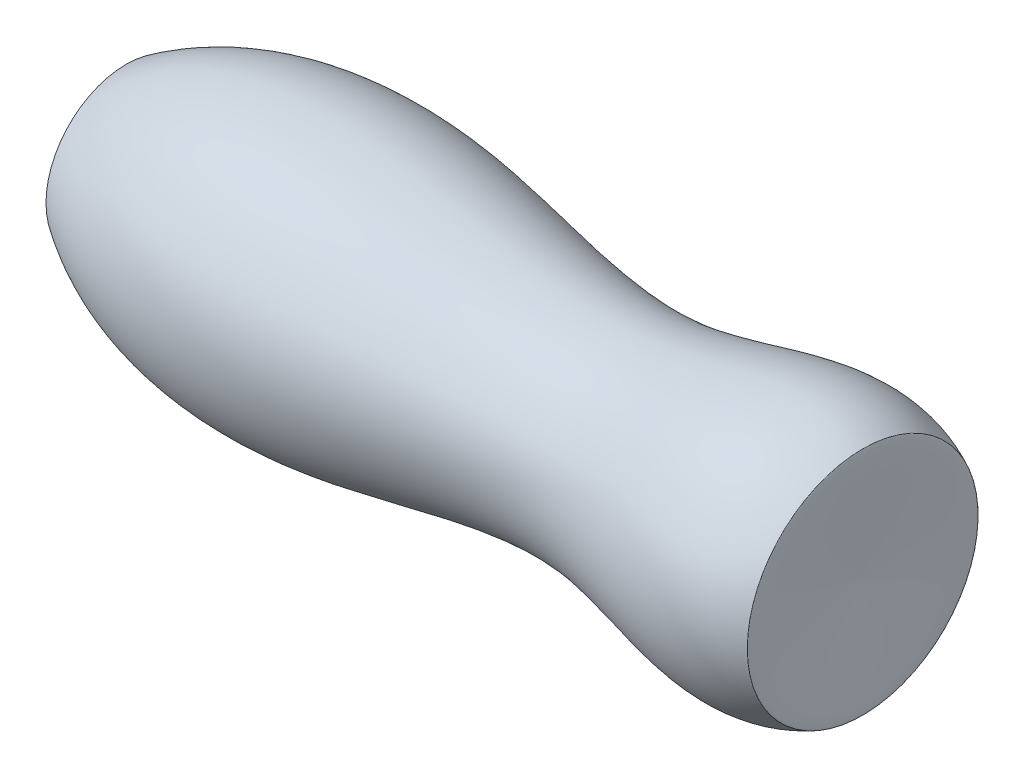
ISO-10303-21;
HEADER;
FILE_DESCRIPTION(('STEP AP214'),'2;1');
FILE_NAME('part.step','',(''),(''),'','','');
FILE_SCHEMA(('AUTOMOTIVE_DESIGN { 1 0 10303 214 1 1 1 1 }'));
ENDSEC;
DATA;
#1=APPLICATION_CONTEXT('core data for automotive mechanical design processes');
#2=APPLICATION_PROTOCOL_DEFINITION('international standard','automotive_design',2000,#1);
#3=PRODUCT_CONTEXT('',#1,'mechanical');
#4=PRODUCT('Part','Part','',(#3));
#5=PRODUCT_RELATED_PRODUCT_CATEGORY('part','',(#4));
#6=PRODUCT_DEFINITION_FORMATION('','',#4);
#7=PRODUCT_DEFINITION_CONTEXT('part definition',#1,'design');
#8=PRODUCT_DEFINITION('design','',#6,#7);
#9=PRODUCT_DEFINITION_SHAPE('','',#8);
#10=(LENGTH_UNIT() NAMED_UNIT(*) SI_UNIT(.MILLI.,.METRE.));
#11=(NAMED_UNIT(*) PLANE_ANGLE_UNIT() SI_UNIT($,.RADIAN.));
#12=(NAMED_UNIT(*) SI_UNIT($,.STERADIAN.) SOLID_ANGLE_UNIT());
#13=UNCERTAINTY_MEASURE_WITH_UNIT(LENGTH_MEASURE(1.E-05),#10,'distance_accuracy_value','');
#14=(GEOMETRIC_REPRESENTATION_CONTEXT(3) GLOBAL_UNCERTAINTY_ASSIGNED_CONTEXT((#13)) GLOBAL_UNIT_ASSIGNED_CONTEXT((#10,
#11,#12)) REPRESENTATION_CONTEXT('',''));
#15=CARTESIAN_POINT('',(0.,0.,0.));
#16=DIRECTION('',(0.,0.,1.));
#17=DIRECTION('',(1.,0.,0.));
#18=AXIS2_PLACEMENT_3D('',#15,#16,#17);
#19=CARTESIAN_POINT('',(-69.6507700752085,13.0391536565325,0.));
#20=CARTESIAN_POINT('',(-68.8499075180765,5.64711978287513,0.));
#21=CARTESIAN_POINT('',(-68.3151731099329,-1.75456200585124,0.));
#22=CARTESIAN_POINT('',(-68.0465669985774,-9.16588762792085,0.));
#23=B_SPLINE_CURVE_WITH_KNOTS('',3,(#19,#20,#21,#22),.UNSPECIFIED.,.F.,.F.,(4,4),(0.,
0.495387551285914),.UNSPECIFIED.);
#24=CARTESIAN_POINT('',(-68.0465669985774,-9.16588762792085,0.));
#25=DIRECTION('',(-1.,0.,0.));
#26=AXIS1_PLACEMENT('',#24,#25);
#27=SURFACE_OF_REVOLUTION('',#23,#26);
#28=CARTESIAN_POINT('',(-68.0465669985774,-9.16588762792085,0.));
#29=VERTEX_POINT('',#28);
#30=VERTEX_LOOP('',#29);
#31=FACE_BOUND('',#30,.T.);
#32=CARTESIAN_POINT('',(-69.6507700752085,-9.16588762792085,0.));
#33=DIRECTION('',(-1.,0.,0.));
#34=DIRECTION('',(0.,0.,1.));
#35=AXIS2_PLACEMENT_3D('',#32,#33,#34);
#36=CIRCLE('',#35,22.2050412844533);
#37=CARTESIAN_POINT('',(-69.6507700752085,-9.16588762792085,22.2050412844533));
#38=VERTEX_POINT('',#37);
#39=EDGE_CURVE('E41',#38,#38,#36,.T.);
#40=ORIENTED_EDGE('',*,*,#39,.T.);
#41=EDGE_LOOP('',(#40));
#42=FACE_BOUND('',#41,.T.);
#43=ADVANCED_FACE('F33',(#31,#42),#27,.T.);
#44=CARTESIAN_POINT('',(133.22994555789,-9.16588762792084,0.));
#45=CARTESIAN_POINT('',(133.78964071506,4.97971391876786,0.));
#46=CARTESIAN_POINT('',(134.948752985883,22.6111389299384,0.));
#47=CARTESIAN_POINT('',(134.363198700469,22.7963434675431,0.));
#48=B_SPLINE_CURVE_WITH_KNOTS('',3,(#44,#45,#46,#47),.UNSPECIFIED.,.F.,.F.,(4,4),(0.,
0.459527671468208),.UNSPECIFIED.);
#49=CARTESIAN_POINT('',(-68.0465669985774,-9.16588762792085,0.));
#50=DIRECTION('',(-1.,0.,0.));
#51=AXIS1_PLACEMENT('',#49,#50);
#52=SURFACE_OF_REVOLUTION('',#48,#51);
#53=CARTESIAN_POINT('',(134.363198700469,-9.16588762792085,0.));
#54=DIRECTION('',(-1.,0.,0.));
#55=DIRECTION('',(0.,0.,1.));
#56=AXIS2_PLACEMENT_3D('',#53,#54,#55);
#57=CIRCLE('',#56,31.962231095464);
#58=CARTESIAN_POINT('',(134.363198700469,-9.16588762792085,31.962231095464));
#59=VERTEX_POINT('',#58);
#60=EDGE_CURVE('E11',#59,#59,#57,.T.);
#61=ORIENTED_EDGE('',*,*,#60,.F.);
#62=EDGE_LOOP('',(#61));
#63=FACE_BOUND('',#62,.T.);
#64=CARTESIAN_POINT('',(133.22994555789,-9.16588762792084,0.));
#65=VERTEX_POINT('',#64);
#66=VERTEX_LOOP('',#65);
#67=FACE_BOUND('',#66,.T.);
#68=ADVANCED_FACE('F49',(#63,#67),#52,.T.);
#69=CARTESIAN_POINT('',(134.363198700469,22.7963434675431,0.));
#70=CARTESIAN_POINT('',(114.229831827158,32.5429351068074,0.));
#71=CARTESIAN_POINT('',(70.6151408692079,9.18687523554214,0.));
#72=CARTESIAN_POINT('',(2.25345401311003,32.9090979648542,0.));
#73=CARTESIAN_POINT('',(-48.2190543640265,27.5965124691007,0.));
#74=CARTESIAN_POINT('',(-69.6507700752085,13.0391536565325,0.));
#75=B_SPLINE_CURVE_WITH_KNOTS('',3,(#69,#70,#71,#72,#73,#74),.UNSPECIFIED.,.F.,.F.,(4,1,1,4),
(0.,0.297681930097793,0.637340369314257,1.),.UNSPECIFIED.);
#76=CARTESIAN_POINT('',(-68.0465669985774,-9.16588762792085,0.));
#77=DIRECTION('',(-1.,0.,0.));
#78=AXIS1_PLACEMENT('',#76,#77);
#79=SURFACE_OF_REVOLUTION('',#75,#78);
#80=ORIENTED_EDGE('',*,*,#39,.F.);
#81=EDGE_LOOP('',(#80));
#82=FACE_BOUND('',#81,.T.);
#83=ORIENTED_EDGE('',*,*,#60,.T.);
#84=EDGE_LOOP('',(#83));
#85=FACE_BOUND('',#84,.T.);
#86=ADVANCED_FACE('F65',(#82,#85),#79,.T.);
#87=CLOSED_SHELL('',(#43,#68,#86));
#88=MANIFOLD_SOLID_BREP('B2',#87);
#89=ADVANCED_BREP_SHAPE_REPRESENTATION('',(#18,#88),#14);
#90=SHAPE_DEFINITION_REPRESENTATION(#9,#89);
ENDSEC;
END-ISO-10303-21;
